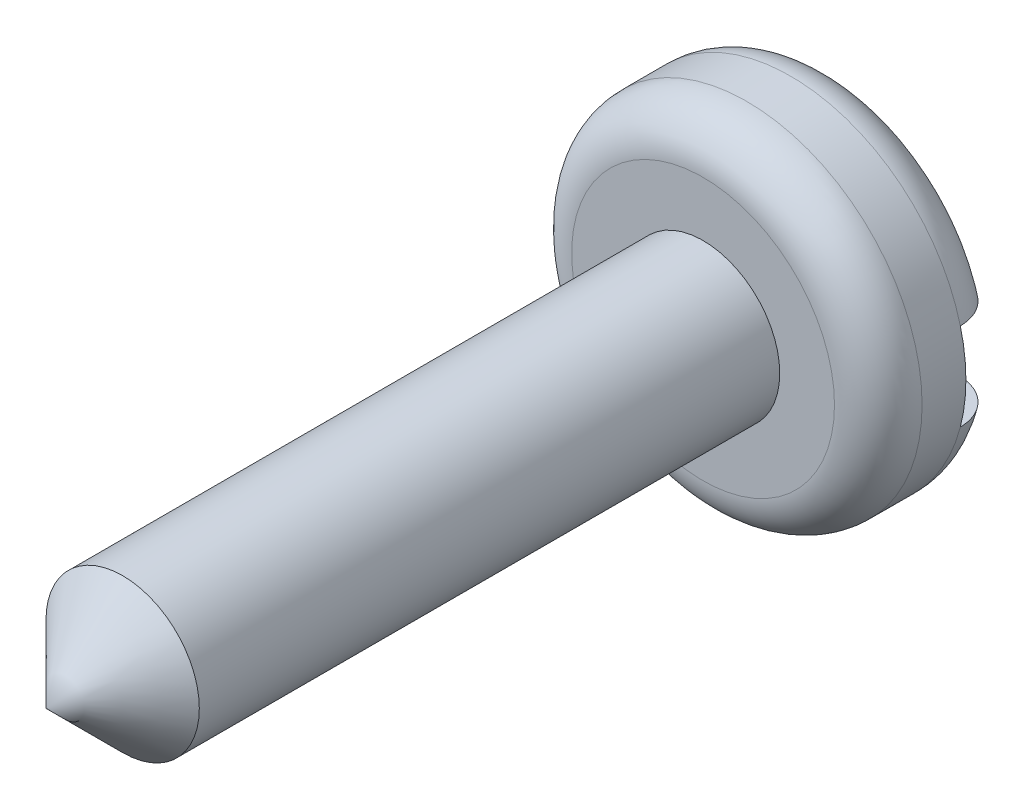
ISO-10303-21;
HEADER;
FILE_DESCRIPTION(('STEP AP214'),'2;1');
FILE_NAME('part.step','',(''),(''),'','','');
FILE_SCHEMA(('AUTOMOTIVE_DESIGN { 1 0 10303 214 1 1 1 1 }'));
ENDSEC;
DATA;
#1=APPLICATION_CONTEXT('core data for automotive mechanical design processes');
#2=APPLICATION_PROTOCOL_DEFINITION('international standard','automotive_design',2000,#1);
#3=PRODUCT_CONTEXT('',#1,'mechanical');
#4=PRODUCT('Part','Part','',(#3));
#5=PRODUCT_RELATED_PRODUCT_CATEGORY('part','',(#4));
#6=PRODUCT_DEFINITION_FORMATION('','',#4);
#7=PRODUCT_DEFINITION_CONTEXT('part definition',#1,'design');
#8=PRODUCT_DEFINITION('design','',#6,#7);
#9=PRODUCT_DEFINITION_SHAPE('','',#8);
#10=(LENGTH_UNIT() NAMED_UNIT(*) SI_UNIT(.MILLI.,.METRE.));
#11=(NAMED_UNIT(*) PLANE_ANGLE_UNIT() SI_UNIT($,.RADIAN.));
#12=(NAMED_UNIT(*) SI_UNIT($,.STERADIAN.) SOLID_ANGLE_UNIT());
#13=UNCERTAINTY_MEASURE_WITH_UNIT(LENGTH_MEASURE(1.E-05),#10,'distance_accuracy_value','');
#14=(GEOMETRIC_REPRESENTATION_CONTEXT(3) GLOBAL_UNCERTAINTY_ASSIGNED_CONTEXT((#13)) GLOBAL_UNIT_ASSIGNED_CONTEXT((#10,
#11,#12)) REPRESENTATION_CONTEXT('',''));
#15=CARTESIAN_POINT('',(0.,0.,0.));
#16=DIRECTION('',(0.,0.,1.));
#17=DIRECTION('',(1.,0.,0.));
#18=AXIS2_PLACEMENT_3D('',#15,#16,#17);
#19=CARTESIAN_POINT('',(0.,0.,0.));
#20=DIRECTION('',(0.,0.,1.));
#21=DIRECTION('',(1.,0.,0.));
#22=AXIS2_PLACEMENT_3D('',#19,#20,#21);
#23=PLANE('',#22);
#24=CARTESIAN_POINT('',(0.,0.,0.));
#25=DIRECTION('',(0.,0.,1.));
#26=DIRECTION('',(1.,0.,0.));
#27=AXIS2_PLACEMENT_3D('',#24,#25,#26);
#28=CIRCLE('',#27,3.);
#29=CARTESIAN_POINT('',(-2.82842712474619,1.,0.));
#30=VERTEX_POINT('',#29);
#31=CARTESIAN_POINT('',(2.82842712474619,1.,0.));
#32=VERTEX_POINT('',#31);
#33=EDGE_CURVE('E126',#30,#32,#28,.F.);
#34=ORIENTED_EDGE('',*,*,#33,.T.);
#35=DIRECTION('',(1.,0.,0.));
#36=VECTOR('',#35,1.);
#37=CARTESIAN_POINT('',(6.17173536215887,1.,0.));
#38=LINE('',#37,#36);
#39=EDGE_CURVE('E173',#30,#32,#38,.T.);
#40=ORIENTED_EDGE('',*,*,#39,.F.);
#41=EDGE_LOOP('',(#34,#40));
#42=FACE_BOUND('',#41,.T.);
#43=ADVANCED_FACE('F39',(#42),#23,.F.);
#44=CARTESIAN_POINT('',(0.,0.,1.));
#45=DIRECTION('',(0.,0.,1.));
#46=DIRECTION('',(1.,0.,0.));
#47=AXIS2_PLACEMENT_3D('',#44,#45,#46);
#48=TOROIDAL_SURFACE('',#47,3.,1.);
#49=CARTESIAN_POINT('',(-3.64919261637876,1.,0.378897333842801));
#50=CARTESIAN_POINT('',(-3.61246829124284,1.,0.334209975057294));
#51=CARTESIAN_POINT('',(-3.57182273981753,1.,0.29267266685047));
#52=CARTESIAN_POINT('',(-3.48403011681508,1.,0.217059540693656));
#53=CARTESIAN_POINT('',(-3.43687198294722,1.,0.182996679297474));
#54=CARTESIAN_POINT('',(-3.33766471841515,1.,0.123259025776858));
#55=CARTESIAN_POINT('',(-3.28562703698927,1.,0.097565201098429));
#56=CARTESIAN_POINT('',(-3.17810296997573,1.,0.0549702755256953));
#57=CARTESIAN_POINT('',(-3.12261754108754,1.,0.0380667475423382));
#58=CARTESIAN_POINT('',(-3.00777317104801,1.,0.0128429918271871));
#59=CARTESIAN_POINT('',(-2.94834671261764,1.,0.00483080172087202));
#60=CARTESIAN_POINT('',(-2.82897631989348,1.,-0.00159564116462503));
#61=CARTESIAN_POINT('',(-2.76903224055403,1.,-7.1103568939486E-06));
#62=CARTESIAN_POINT('',(-2.6472708384319,1.,0.0128422925574044));
#63=CARTESIAN_POINT('',(-2.58550212430651,1.,0.0245647888045193));
#64=CARTESIAN_POINT('',(-2.4646697470406,1.,0.0578517741792593));
#65=CARTESIAN_POINT('',(-2.40560678606223,1.,0.0794188022905919));
#66=CARTESIAN_POINT('',(-2.28977043599634,1.,0.132721610993942));
#67=CARTESIAN_POINT('',(-2.23314594038648,1.,0.164782002317626));
#68=CARTESIAN_POINT('',(-2.12614398768344,1.,0.238084942865307));
#69=CARTESIAN_POINT('',(-2.07576824200821,1.,0.279329998992792));
#70=CARTESIAN_POINT('',(-1.98379387873606,1.,0.369442360556052));
#71=CARTESIAN_POINT('',(-1.94207572966021,1.,0.418187015280968));
#72=CARTESIAN_POINT('',(-1.86845583157665,1.,0.522613781020483));
#73=CARTESIAN_POINT('',(-1.83654566049022,1.,0.578289881968131));
#74=CARTESIAN_POINT('',(-1.78709737368201,1.,0.689264703615614));
#75=CARTESIAN_POINT('',(-1.76846247440006,1.,0.744072419385683));
#76=CARTESIAN_POINT('',(-1.74214733309541,1.,0.856241261169753));
#77=CARTESIAN_POINT('',(-1.73445420066598,1.,0.913599300339002));
#78=CARTESIAN_POINT('',(-1.73084715779128,1.,1.02156224002316));
#79=CARTESIAN_POINT('',(-1.7335962352882,1.,1.07212660231783));
#80=CARTESIAN_POINT('',(-1.74776639815729,1.,1.17201943658103));
#81=CARTESIAN_POINT('',(-1.75918748554878,1.,1.22134790826178));
#82=CARTESIAN_POINT('',(-1.78968272820642,1.,1.31634010173021));
#83=CARTESIAN_POINT('',(-1.8085812374816,1.,1.36206089143509));
#84=CARTESIAN_POINT('',(-1.85313687686153,1.,1.45006787022117));
#85=CARTESIAN_POINT('',(-1.87879592715948,1.,1.49235307902441));
#86=CARTESIAN_POINT('',(-1.93861992774949,1.,1.57655840628574));
#87=CARTESIAN_POINT('',(-1.9733576123982,1.,1.61807079283924));
#88=CARTESIAN_POINT('',(-2.04862460837548,1.,1.69545786058549));
#89=CARTESIAN_POINT('',(-2.08915670758346,1.,1.73132981043539));
#90=CARTESIAN_POINT('',(-2.18006426230812,1.,1.80081027086803));
#91=CARTESIAN_POINT('',(-2.23103714592975,1.,1.83363892322462));
#92=CARTESIAN_POINT('',(-2.33749595959869,1.,1.89091907073592));
#93=CARTESIAN_POINT('',(-2.39298358522971,1.,1.91536740038904));
#94=CARTESIAN_POINT('',(-2.51097262656985,1.,1.9566779062118));
#95=CARTESIAN_POINT('',(-2.57369454510078,1.,1.97291412212961));
#96=CARTESIAN_POINT('',(-2.700983475594,1.,1.99462360905896));
#97=CARTESIAN_POINT('',(-2.76555060284081,1.,2.00009620608553));
#98=CARTESIAN_POINT('',(-2.89460991780328,1.,1.99990136629152));
#99=CARTESIAN_POINT('',(-2.95910210766962,1.,1.99424652406659));
#100=CARTESIAN_POINT('',(-3.08610159103586,1.,1.97170783946254));
#101=CARTESIAN_POINT('',(-3.14860929616319,1.,1.95482634190366));
#102=CARTESIAN_POINT('',(-3.26706008823211,1.,1.91101072015656));
#103=CARTESIAN_POINT('',(-3.32316790541548,1.,1.8845224593714));
#104=CARTESIAN_POINT('',(-3.42981180048591,1.,1.82202844304872));
#105=CARTESIAN_POINT('',(-3.48034948276044,1.,1.78602543828494));
#106=CARTESIAN_POINT('',(-3.5717549595939,1.,1.7074651763323));
#107=CARTESIAN_POINT('',(-3.61297761225985,1.,1.66532063306448));
#108=CARTESIAN_POINT('',(-3.68739921164548,1.,1.57445711562582));
#109=CARTESIAN_POINT('',(-3.72060013192047,1.,1.52573976314336));
#110=CARTESIAN_POINT('',(-3.77666180946586,1.,1.42524395645279));
#111=CARTESIAN_POINT('',(-3.79988449445979,1.,1.37366720330487));
#112=CARTESIAN_POINT('',(-3.8370874932321,1.,1.26728454348738));
#113=CARTESIAN_POINT('',(-3.85106974548789,1.,1.21247931672288));
#114=CARTESIAN_POINT('',(-3.86908893013128,1.,1.10267337847261));
#115=CARTESIAN_POINT('',(-3.8733663936881,1.,1.04771200993106));
#116=CARTESIAN_POINT('',(-3.87254642808437,1.,0.937843717001537));
#117=CARTESIAN_POINT('',(-3.86744696286752,1.,0.882936807028583));
#118=CARTESIAN_POINT('',(-3.84811915821359,1.,0.775214759825382));
#119=CARTESIAN_POINT('',(-3.83396358370818,1.,0.722386480723824));
#120=CARTESIAN_POINT('',(-3.7970545910158,1.,0.619883595919917));
#121=CARTESIAN_POINT('',(-3.77431302491925,1.,0.570204752648263));
#122=CARTESIAN_POINT('',(-3.73340181697249,1.,0.497406676857816));
#123=CARTESIAN_POINT('',(-3.71802299051624,1.,0.472678399414136));
#124=CARTESIAN_POINT('',(-3.6851578718343,1.,0.424666704682951));
#125=CARTESIAN_POINT('',(-3.66767165706015,1.,0.401383234342951));
#126=CARTESIAN_POINT('',(-3.64919261637876,1.,0.378897333842801));
#127=B_SPLINE_CURVE_WITH_KNOTS('',3,(#49,#50,#51,#52,#53,#54,#55,#56,#57,#58,#59,#60,#61,#62,
#63,#64,#65,#66,#67,#68,#69,#70,#71,#72,#73,#74,#75,#76,#77,#78,#79,#80,#81,#82,#83,#84,#85,#86,
#87,#88,#89,#90,#91,#92,#93,#94,#95,#96,#97,#98,#99,#100,#101,#102,#103,#104,#105,#106,#107,
#108,#109,#110,#111,#112,#113,#114,#115,#116,#117,#118,#119,#120,#121,#122,#123,#124,#125,#126),
.UNSPECIFIED.,.T.,.F.,(4,2,2,2,2,2,2,2,2,2,2,2,2,2,2,2,2,2,2,2,2,2,2,2,2,2,2,2,2,2,2,2,2,2,2,2,
2,2,4),(0.,0.17341289048321,0.34712404900796,0.520437356131995,0.69370278427219,
0.872799829737298,1.0519488042302,1.23971596911835,1.42753158804966,1.62181514087839,
1.81615178746787,2.00759452225808,2.19887240354152,2.37152756897142,2.54397916179065,
2.69513969078691,2.8463002549815,2.99410284817722,3.14194746701218,3.30368559089984,
3.46550179575339,3.64661194733467,3.82779043451023,4.02124009008946,4.21470185851019,
4.40794478311448,4.60114735931068,4.78633868776632,4.97147653467569,5.14744892261805,
5.32337797257932,5.49223680329954,5.6610601992052,5.82565137676776,5.99027829700086,
6.15359879124428,6.31669465754746,6.40395620932971,6.49121455501904),.UNSPECIFIED.);
#128=CARTESIAN_POINT('',(-3.87298334620742,1.,1.));
#129=VERTEX_POINT('',#128);
#130=EDGE_CURVE('E48',#129,#30,#127,.T.);
#131=ORIENTED_EDGE('',*,*,#130,.F.);
#132=CARTESIAN_POINT('',(0.,0.,1.));
#133=DIRECTION('',(0.,0.,1.));
#134=DIRECTION('',(1.,0.,0.));
#135=AXIS2_PLACEMENT_3D('',#132,#133,#134);
#136=CIRCLE('',#135,4.);
#137=CARTESIAN_POINT('',(3.87298334620742,1.,1.));
#138=VERTEX_POINT('',#137);
#139=EDGE_CURVE('E133',#138,#129,#136,.T.);
#140=ORIENTED_EDGE('',*,*,#139,.F.);
#141=CARTESIAN_POINT('',(1.80454052912611,1.,0.650412331675416));
#142=CARTESIAN_POINT('',(1.82733564227056,1.,0.596984686528466));
#143=CARTESIAN_POINT('',(1.85512695409011,1.,0.545610280743063));
#144=CARTESIAN_POINT('',(1.91917221491779,1.,0.44834058832476));
#145=CARTESIAN_POINT('',(1.95545034759685,1.,0.402461536743335));
#146=CARTESIAN_POINT('',(2.03472745512996,1.,0.317415138302336));
#147=CARTESIAN_POINT('',(2.07768954567703,1.,0.278213293769102));
#148=CARTESIAN_POINT('',(2.16909853569401,1.,0.206926443062701));
#149=CARTESIAN_POINT('',(2.21754271430982,1.,0.17483792961857));
#150=CARTESIAN_POINT('',(2.32292879249958,1.,0.115948359664502));
#151=CARTESIAN_POINT('',(2.38024241475681,1.,0.0898106906604875));
#152=CARTESIAN_POINT('',(2.49835854595117,1.,0.0471408751783221));
#153=CARTESIAN_POINT('',(2.55916237767374,1.,0.0306123973372757));
#154=CARTESIAN_POINT('',(2.68483407257146,1.,0.00729626138547736));
#155=CARTESIAN_POINT('',(2.74976968404556,1.,0.000870233046596974));
#156=CARTESIAN_POINT('',(2.87978602000167,1.,-0.000704713065899704));
#157=CARTESIAN_POINT('',(2.94486673043529,1.,0.00414532107157648));
#158=CARTESIAN_POINT('',(3.07160057441872,1.,0.0249969888180926));
#159=CARTESIAN_POINT('',(3.13329857714227,1.,0.0407244031872187));
#160=CARTESIAN_POINT('',(3.25294779689383,1.,0.0828418085981355));
#161=CARTESIAN_POINT('',(3.31090002929504,1.,0.109228895921502));
#162=CARTESIAN_POINT('',(3.41840060401574,1.,0.170550133652877));
#163=CARTESIAN_POINT('',(3.46821977750479,1.,0.205009429826692));
#164=CARTESIAN_POINT('',(3.56099783551873,1.,0.28218108711557));
#165=CARTESIAN_POINT('',(3.60395862641663,1.,0.324891147507152));
#166=CARTESIAN_POINT('',(3.67969826358568,1.,0.415185384427619));
#167=CARTESIAN_POINT('',(3.71285769774479,1.,0.462450536940048));
#168=CARTESIAN_POINT('',(3.77044619987703,1.,0.562030626723517));
#169=CARTESIAN_POINT('',(3.79487711958101,1.,0.614344489929528));
#170=CARTESIAN_POINT('',(3.8335016955855,1.,0.720636648548462));
#171=CARTESIAN_POINT('',(3.84801099359635,1.,0.774500409527679));
#172=CARTESIAN_POINT('',(3.86760231954654,1.,0.883914825563264));
#173=CARTESIAN_POINT('',(3.87268548576308,1.,0.939465276115491));
#174=CARTESIAN_POINT('',(3.8732508221602,1.,1.04964495217732));
#175=CARTESIAN_POINT('',(3.86889832192387,1.,1.10427340879512));
#176=CARTESIAN_POINT('',(3.85107174509836,1.,1.21201831105009));
#177=CARTESIAN_POINT('',(3.83759798402113,1.,1.26513480892094));
#178=CARTESIAN_POINT('',(3.80198008919852,1.,1.36831628622124));
#179=CARTESIAN_POINT('',(3.77984406569282,1.,1.41838406955388));
#180=CARTESIAN_POINT('',(3.72759926122775,1.,1.51416605873901));
#181=CARTESIAN_POINT('',(3.69749012843155,1.,1.55988007234758));
#182=CARTESIAN_POINT('',(3.62971259861727,1.,1.64642082838685));
#183=CARTESIAN_POINT('',(3.59193770980213,1.,1.68716409136436));
#184=CARTESIAN_POINT('',(3.51026030542915,1.,1.76195049780548));
#185=CARTESIAN_POINT('',(3.46635709112837,1.,1.79599287617552));
#186=CARTESIAN_POINT('',(3.37229757441458,1.,1.8575273826406));
#187=CARTESIAN_POINT('',(3.3219939157208,1.,1.88479407741084));
#188=CARTESIAN_POINT('',(3.21766120608909,1.,1.93087980880545));
#189=CARTESIAN_POINT('',(3.16363149652713,1.,1.94969734750253));
#190=CARTESIAN_POINT('',(3.05096434144294,1.,1.97921477279298));
#191=CARTESIAN_POINT('',(2.99222867204826,1.,1.98953938747994));
#192=CARTESIAN_POINT('',(2.87386575261448,1.,2.00066868078162));
#193=CARTESIAN_POINT('',(2.81423829904846,1.,2.00147115196093));
#194=CARTESIAN_POINT('',(2.69274321411743,1.,1.99354794260875));
#195=CARTESIAN_POINT('',(2.63090545892967,1.,1.98436299833855));
#196=CARTESIAN_POINT('',(2.50951757591248,1.,1.95613733003393));
#197=CARTESIAN_POINT('',(2.44996803355343,1.,1.93709410142498));
#198=CARTESIAN_POINT('',(2.33251699096482,1.,1.88879805714307));
#199=CARTESIAN_POINT('',(2.27476209452056,1.,1.8591876413013));
#200=CARTESIAN_POINT('',(2.16504100441597,1.,1.79063909658527));
#201=CARTESIAN_POINT('',(2.1130766184798,1.,1.75169806669703));
#202=CARTESIAN_POINT('',(2.01702604048045,1.,1.66559457852408));
#203=CARTESIAN_POINT('',(1.97289236593093,1.,1.61848535508695));
#204=CARTESIAN_POINT('',(1.89405458528472,1.,1.51692534113208));
#205=CARTESIAN_POINT('',(1.8593436749435,1.,1.46247989089578));
#206=CARTESIAN_POINT('',(1.80395346955058,1.,1.3527787762878));
#207=CARTESIAN_POINT('',(1.78231146726499,1.,1.298011759046));
#208=CARTESIAN_POINT('',(1.75007375885358,1.,1.18531186246959));
#209=CARTESIAN_POINT('',(1.73946751412064,1.,1.12738205919617));
#210=CARTESIAN_POINT('',(1.73072871128562,1.,1.01802159475462));
#211=CARTESIAN_POINT('',(1.73118407976635,1.,0.966699039052564));
#212=CARTESIAN_POINT('',(1.74110754539552,1.,0.864988507701978));
#213=CARTESIAN_POINT('',(1.75056109441266,1.,0.81459915730209));
#214=CARTESIAN_POINT('',(1.76962628570817,1.,0.745839139600592));
#215=CARTESIAN_POINT('',(1.775725641812,1.,0.72643247266142));
#216=CARTESIAN_POINT('',(1.78919300721113,1.,0.688070864248412));
#217=CARTESIAN_POINT('',(1.79656062731025,1.,0.669115786219535));
#218=CARTESIAN_POINT('',(1.80454052912611,1.,0.650412331675416));
#219=B_SPLINE_CURVE_WITH_KNOTS('',3,(#141,#142,#143,#144,#145,#146,#147,#148,#149,#150,#151,
#152,#153,#154,#155,#156,#157,#158,#159,#160,#161,#162,#163,#164,#165,#166,#167,#168,#169,#170,
#171,#172,#173,#174,#175,#176,#177,#178,#179,#180,#181,#182,#183,#184,#185,#186,#187,#188,#189,
#190,#191,#192,#193,#194,#195,#196,#197,#198,#199,#200,#201,#202,#203,#204,#205,#206,#207,#208,
#209,#210,#211,#212,#213,#214,#215,#216,#217,#218),.UNSPECIFIED.,.T.,.F.,(4,2,2,2,2,2,2,2,2,2,2,
2,2,2,2,2,2,2,2,2,2,2,2,2,2,2,2,2,2,2,2,2,2,2,2,2,2,2,4),(0.,0.174178142462621,
0.348858794655957,0.522607622456415,0.696270590855761,0.884404317135718,1.07260982280651,
1.26741035602158,1.46219278361548,1.65223564412789,1.84222677141603,2.0230332306349,
2.20378934460626,2.3761397314861,2.54845353295372,2.71499259832305,2.8815115515218,
3.04513641034,3.20875560952792,3.37222198165287,3.53569556841308,3.70161824784469,
3.86755986102035,4.03844662852224,4.20936368011134,4.3874792701433,4.56563615035137,
4.75234573977393,4.93910278752957,5.13289556741605,5.32674867845842,5.51938286742825,
5.71187758161893,5.88751215743834,6.06297885648947,6.21617952361257,6.36913291804395,
6.43012627085521,6.49110093970256),.UNSPECIFIED.);
#220=EDGE_CURVE('E156',#32,#138,#219,.T.);
#221=ORIENTED_EDGE('',*,*,#220,.F.);
#222=ORIENTED_EDGE('',*,*,#33,.F.);
#223=EDGE_LOOP('',(#131,#140,#221,#222));
#224=FACE_BOUND('',#223,.T.);
#225=ADVANCED_FACE('F93',(#224),#48,.T.);
#226=CARTESIAN_POINT('',(0.,0.,3.));
#227=DIRECTION('',(0.,0.,-1.));
#228=DIRECTION('',(-1.,0.,0.));
#229=AXIS2_PLACEMENT_3D('',#226,#227,#228);
#230=CYLINDRICAL_SURFACE('',#229,4.);
#231=ORIENTED_EDGE('',*,*,#139,.T.);
#232=CARTESIAN_POINT('',(-3.87298334620742,-1.,1.));
#233=VERTEX_POINT('',#232);
#234=EDGE_CURVE('E170',#129,#233,#136,.T.);
#235=ORIENTED_EDGE('',*,*,#234,.T.);
#236=CARTESIAN_POINT('',(3.87298334620742,-1.,1.));
#237=VERTEX_POINT('',#236);
#238=EDGE_CURVE('E176',#233,#237,#136,.T.);
#239=ORIENTED_EDGE('',*,*,#238,.T.);
#240=EDGE_CURVE('E171',#237,#138,#136,.T.);
#241=ORIENTED_EDGE('',*,*,#240,.T.);
#242=EDGE_LOOP('',(#231,#235,#239,#241));
#243=FACE_BOUND('',#242,.T.);
#244=CARTESIAN_POINT('',(0.,0.,2.));
#245=DIRECTION('',(0.,0.,1.));
#246=DIRECTION('',(1.,0.,0.));
#247=AXIS2_PLACEMENT_3D('',#244,#245,#246);
#248=CIRCLE('',#247,4.);
#249=CARTESIAN_POINT('',(4.,0.,2.));
#250=VERTEX_POINT('',#249);
#251=EDGE_CURVE('E182',#250,#250,#248,.F.);
#252=ORIENTED_EDGE('',*,*,#251,.T.);
#253=EDGE_LOOP('',(#252));
#254=FACE_BOUND('',#253,.T.);
#255=ADVANCED_FACE('F100',(#243,#254),#230,.T.);
#256=CARTESIAN_POINT('',(0.,0.,3.));
#257=DIRECTION('',(0.,0.,1.));
#258=DIRECTION('',(1.,0.,0.));
#259=AXIS2_PLACEMENT_3D('',#256,#257,#258);
#260=PLANE('',#259);
#261=CARTESIAN_POINT('',(0.,0.,3.));
#262=DIRECTION('',(0.,0.,1.));
#263=DIRECTION('',(1.,0.,0.));
#264=AXIS2_PLACEMENT_3D('',#261,#262,#263);
#265=CIRCLE('',#264,3.);
#266=CARTESIAN_POINT('',(3.,0.,3.));
#267=VERTEX_POINT('',#266);
#268=EDGE_CURVE('E125',#267,#267,#265,.T.);
#269=ORIENTED_EDGE('',*,*,#268,.T.);
#270=EDGE_LOOP('',(#269));
#271=FACE_BOUND('',#270,.T.);
#272=CARTESIAN_POINT('',(0.,0.,3.));
#273=DIRECTION('',(0.,0.,1.));
#274=DIRECTION('',(1.,0.,0.));
#275=AXIS2_PLACEMENT_3D('',#272,#273,#274);
#276=CIRCLE('',#275,1.75);
#277=CARTESIAN_POINT('',(1.75,0.,3.));
#278=VERTEX_POINT('',#277);
#279=EDGE_CURVE('E185',#278,#278,#276,.T.);
#280=ORIENTED_EDGE('',*,*,#279,.F.);
#281=EDGE_LOOP('',(#280));
#282=FACE_BOUND('',#281,.T.);
#283=ADVANCED_FACE('F109',(#271,#282),#260,.T.);
#284=CARTESIAN_POINT('',(2.82842712474619,-1.,0.));
#285=VERTEX_POINT('',#284);
#286=CARTESIAN_POINT('',(-2.82842712474619,-1.,0.));
#287=VERTEX_POINT('',#286);
#288=EDGE_CURVE('E120',#285,#287,#28,.F.);
#289=ORIENTED_EDGE('',*,*,#288,.T.);
#290=DIRECTION('',(-1.,0.,0.));
#291=VECTOR('',#290,1.);
#292=CARTESIAN_POINT('',(6.17173536215887,-1.,0.));
#293=LINE('',#292,#291);
#294=EDGE_CURVE('E121',#285,#287,#293,.T.);
#295=ORIENTED_EDGE('',*,*,#294,.F.);
#296=EDGE_LOOP('',(#289,#295));
#297=FACE_BOUND('',#296,.T.);
#298=ADVANCED_FACE('F96',(#297),#23,.F.);
#299=CARTESIAN_POINT('',(0.,0.,18.));
#300=DIRECTION('',(0.,0.,-1.));
#301=DIRECTION('',(-1.,0.,0.));
#302=AXIS2_PLACEMENT_3D('',#299,#300,#301);
#303=CYLINDRICAL_SURFACE('',#302,1.75);
#304=CARTESIAN_POINT('',(0.,0.,16.25));
#305=DIRECTION('',(0.,0.,1.));
#306=DIRECTION('',(1.,0.,0.));
#307=AXIS2_PLACEMENT_3D('',#304,#305,#306);
#308=CIRCLE('',#307,1.75);
#309=CARTESIAN_POINT('',(1.75,0.,16.25));
#310=VERTEX_POINT('',#309);
#311=EDGE_CURVE('E11',#310,#310,#308,.F.);
#312=ORIENTED_EDGE('',*,*,#311,.T.);
#313=EDGE_LOOP('',(#312));
#314=FACE_BOUND('',#313,.T.);
#315=ORIENTED_EDGE('',*,*,#279,.T.);
#316=EDGE_LOOP('',(#315));
#317=FACE_BOUND('',#316,.T.);
#318=ADVANCED_FACE('F108',(#314,#317),#303,.T.);
#319=CARTESIAN_POINT('',(-3.64919261637876,-1.,0.378897333842801));
#320=CARTESIAN_POINT('',(-3.68421774880566,-1.,0.421525273544426));
#321=CARTESIAN_POINT('',(-3.71573121866812,-1.,0.467084208022854));
#322=CARTESIAN_POINT('',(-3.77072271793606,-1.,0.562863774990084));
#323=CARTESIAN_POINT('',(-3.7941932176755,-1.,0.613088720106644));
#324=CARTESIAN_POINT('',(-3.83232306529217,-1.,0.716807044888567));
#325=CARTESIAN_POINT('',(-3.84697939804536,-1.,0.770301536104798));
#326=CARTESIAN_POINT('',(-3.86697833853991,-1.,0.878993754249563));
#327=CARTESIAN_POINT('',(-3.87232301456639,-1.,0.934191100170905));
#328=CARTESIAN_POINT('',(-3.8735215186672,-1.,1.04404862375726));
#329=CARTESIAN_POINT('',(-3.86948428851038,-1.,1.09870763945698));
#330=CARTESIAN_POINT('',(-3.85227604476183,-1.,1.20656670459816));
#331=CARTESIAN_POINT('',(-3.83910509251853,-1.,1.25976676383649));
#332=CARTESIAN_POINT('',(-3.80407540261861,-1.,1.36315032804431));
#333=CARTESIAN_POINT('',(-3.78222699198927,-1.,1.41333733740324));
#334=CARTESIAN_POINT('',(-3.73053163039543,-1.,1.50940223622213));
#335=CARTESIAN_POINT('',(-3.70068434688085,-1.,1.55527994641752));
#336=CARTESIAN_POINT('',(-3.63341013265124,-1.,1.64217767154251));
#337=CARTESIAN_POINT('',(-3.59587810431412,-1.,1.68311624745889));
#338=CARTESIAN_POINT('',(-3.51465000927728,-1.,1.75832840803727));
#339=CARTESIAN_POINT('',(-3.47095325435915,-1.,1.79260124753158));
#340=CARTESIAN_POINT('',(-3.37728222045449,-1.,1.85462408883627));
#341=CARTESIAN_POINT('',(-3.3271605468789,-1.,1.88215129827028));
#342=CARTESIAN_POINT('',(-3.22314696513099,-1.,1.92878234896095));
#343=CARTESIAN_POINT('',(-3.16925439308441,-1.,1.94788470265974));
#344=CARTESIAN_POINT('',(-3.05682907266059,-1.,1.97799766682329));
#345=CARTESIAN_POINT('',(-2.99819650992226,-1.,1.98863527366622));
#346=CARTESIAN_POINT('',(-2.87998845672231,-1.,2.00040284091296));
#347=CARTESIAN_POINT('',(-2.82041275056072,-1.,2.0015305939671));
#348=CARTESIAN_POINT('',(-2.6989710313189,-1.,1.99427879085429));
#349=CARTESIAN_POINT('',(-2.63713235610346,-1.,1.98544025698446));
#350=CARTESIAN_POINT('',(-2.51568597409779,-1.,1.95790653105362));
#351=CARTESIAN_POINT('',(-2.45607883234357,-1.,1.93920886044527));
#352=CARTESIAN_POINT('',(-2.33842761694778,-1.,1.89160140125571));
#353=CARTESIAN_POINT('',(-2.28052948653965,-1.,1.86232986848529));
#354=CARTESIAN_POINT('',(-2.17045977140093,-1.,1.79444097719273));
#355=CARTESIAN_POINT('',(-2.11828996854253,-1.,1.75582072253099));
#356=CARTESIAN_POINT('',(-2.02170750318936,-1.,1.6702853738109));
#357=CARTESIAN_POINT('',(-1.97725596550883,-1.,1.62341439540988));
#358=CARTESIAN_POINT('',(-1.89772373636244,-1.,1.52227600695239));
#359=CARTESIAN_POINT('',(-1.86263706889656,-1.,1.46801334730142));
#360=CARTESIAN_POINT('',(-1.80643405929272,-1.,1.35850607954028));
#361=CARTESIAN_POINT('',(-1.78437537934672,-1.,1.30374775389467));
#362=CARTESIAN_POINT('',(-1.7513214578145,-1.,1.19100481592052));
#363=CARTESIAN_POINT('',(-1.74031171809329,-1.,1.13302453713014));
#364=CARTESIAN_POINT('',(-1.73085902055685,-1.,1.02353687911254));
#365=CARTESIAN_POINT('',(-1.73099013277704,-1.,0.972149002551751));
#366=CARTESIAN_POINT('',(-1.74029509334647,-1.,0.870204330538246));
#367=CARTESIAN_POINT('',(-1.74946799175208,-1.,0.819647448347301));
#368=CARTESIAN_POINT('',(-1.77571772659471,-1.,0.722908283302294));
#369=CARTESIAN_POINT('',(-1.79245157525915,-1.,0.67663154358046));
#370=CARTESIAN_POINT('',(-1.83286691955322,-1.,0.587231421077743));
#371=CARTESIAN_POINT('',(-1.85655018472788,-1.,0.544108844946483));
#372=CARTESIAN_POINT('',(-1.91213942825224,-1.,0.458398160310175));
#373=CARTESIAN_POINT('',(-1.94456151624895,-1.,0.416145756774348));
#374=CARTESIAN_POINT('',(-2.01532201572512,-1.,0.336932402159019));
#375=CARTESIAN_POINT('',(-2.05366319916079,-1.,0.299973945988354));
#376=CARTESIAN_POINT('',(-2.14017350344001,-1.,0.227756013007773));
#377=CARTESIAN_POINT('',(-2.18897066641048,-1.,0.193247512393862));
#378=CARTESIAN_POINT('',(-2.29132619189354,-1.,0.132206077178104));
#379=CARTESIAN_POINT('',(-2.34488650876452,-1.,0.105676436108591));
#380=CARTESIAN_POINT('',(-2.45975220218697,-1.,0.0594254557303246));
#381=CARTESIAN_POINT('',(-2.52133607697502,-1.,0.0403920226492902));
#382=CARTESIAN_POINT('',(-2.64681911964728,-1.,0.0128387056459453));
#383=CARTESIAN_POINT('',(-2.71071844991052,-1.,0.00431956054764131));
#384=CARTESIAN_POINT('',(-2.83952321891512,-1.,-0.00179756049557264));
#385=CARTESIAN_POINT('',(-2.90443259956797,-1.,0.000685033821560769));
#386=CARTESIAN_POINT('',(-3.03284571779345,-1.,0.0169601469038369));
#387=CARTESIAN_POINT('',(-3.09634932690877,-1.,0.0307536949017249));
#388=CARTESIAN_POINT('',(-3.21753834111487,-1.,0.0687785695905201));
#389=CARTESIAN_POINT('',(-3.27535260668029,-1.,0.0925993019966963));
#390=CARTESIAN_POINT('',(-3.38579347545679,-1.,0.150091956074958));
#391=CARTESIAN_POINT('',(-3.43842837966274,-1.,0.183747759577418));
#392=CARTESIAN_POINT('',(-3.5172967723212,-1.,0.244932928170913));
#393=CARTESIAN_POINT('',(-3.5457566600515,-1.,0.269644856727018));
#394=CARTESIAN_POINT('',(-3.59975362196187,-1.,0.322082057208095));
#395=CARTESIAN_POINT('',(-3.62529080212466,-1.,0.349807219796562));
#396=CARTESIAN_POINT('',(-3.64919261637876,-1.,0.378897333842801));
#397=B_SPLINE_CURVE_WITH_KNOTS('',3,(#319,#320,#321,#322,#323,#324,#325,#326,#327,#328,#329,
#330,#331,#332,#333,#334,#335,#336,#337,#338,#339,#340,#341,#342,#343,#344,#345,#346,#347,#348,
#349,#350,#351,#352,#353,#354,#355,#356,#357,#358,#359,#360,#361,#362,#363,#364,#365,#366,#367,
#368,#369,#370,#371,#372,#373,#374,#375,#376,#377,#378,#379,#380,#381,#382,#383,#384,#385,#386,
#387,#388,#389,#390,#391,#392,#393,#394,#395,#396),.UNSPECIFIED.,.T.,.F.,(4,2,2,2,2,2,2,2,2,2,2,
2,2,2,2,2,2,2,2,2,2,2,2,2,2,2,2,2,2,2,2,2,2,2,2,2,2,2,4),(0.,0.165380840917981,
0.330916087751577,0.496507928228473,0.662062983111424,0.825705250260756,0.989346418285467,
1.15279341803051,1.31624721407641,1.48210686649335,1.64798504984166,1.81876717256352,
1.98957943784094,2.16755619619961,2.34557426393417,2.5321377268739,2.71874811349508,
2.91246419841399,3.1062403715924,3.29901028573085,3.49165689199226,3.66772640012856,
3.84356457111482,3.99693575215231,4.15029082150036,4.29729623412107,4.44433911158016,
4.60347661430523,4.76268886964584,4.9412299082907,5.11984454469074,5.31231684657553,
5.50480267244432,5.69870047136714,5.89261591584997,6.07926324301833,6.2656063831334,
6.37846949761758,6.49132851818112),.UNSPECIFIED.);
#398=EDGE_CURVE('E141',#287,#233,#397,.T.);
#399=ORIENTED_EDGE('',*,*,#398,.F.);
#400=ORIENTED_EDGE('',*,*,#288,.F.);
#401=CARTESIAN_POINT('',(1.80454052912611,-1.,0.650412331675416));
#402=CARTESIAN_POINT('',(1.78501403077482,-1.,0.696188462293334));
#403=CARTESIAN_POINT('',(1.76912481108878,-1.,0.743532357933149));
#404=CARTESIAN_POINT('',(1.74545627326973,-1.,0.840218847889596));
#405=CARTESIAN_POINT('',(1.73767599847123,-1.,0.889561205720812));
#406=CARTESIAN_POINT('',(1.73069098709458,-1.,0.98893034915362));
#407=CARTESIAN_POINT('',(1.73149900893485,-1.,1.03895804273146));
#408=CARTESIAN_POINT('',(1.74167051475476,-1.,1.13813148310028));
#409=CARTESIAN_POINT('',(1.75103489479043,-1.,1.18727713697089));
#410=CARTESIAN_POINT('',(1.77755723399994,-1.,1.28259654690556));
#411=CARTESIAN_POINT('',(1.79459577474986,-1.,1.3288038991579));
#412=CARTESIAN_POINT('',(1.83559644088642,-1.,1.41802494955281));
#413=CARTESIAN_POINT('',(1.85956068083859,-1.,1.46103766725516));
#414=CARTESIAN_POINT('',(1.91574707512422,-1.,1.54654875792902));
#415=CARTESIAN_POINT('',(1.94849285502419,-1.,1.58870215702559));
#416=CARTESIAN_POINT('',(2.01988292900957,-1.,1.66766898849577));
#417=CARTESIAN_POINT('',(2.05852991416201,-1.,1.70447996960674));
#418=CARTESIAN_POINT('',(2.14565957333874,-1.,1.77632950272094));
#419=CARTESIAN_POINT('',(2.1947666390634,-1.,1.8106123025238));
#420=CARTESIAN_POINT('',(2.29770897470277,-1.,1.87114588883134));
#421=CARTESIAN_POINT('',(2.35154617372093,-1.,1.89739337852005));
#422=CARTESIAN_POINT('',(2.46686810930972,-1.,1.94296865639008));
#423=CARTESIAN_POINT('',(2.52862298141813,-1.,1.96161667350933));
#424=CARTESIAN_POINT('',(2.65438564480137,-1.,1.98836271191685));
#425=CARTESIAN_POINT('',(2.71839366607177,-1.,1.99645965295291));
#426=CARTESIAN_POINT('',(2.84727045860239,-1.,2.00169496383021));
#427=CARTESIAN_POINT('',(2.91214210675368,-1.,1.99876496105989));
#428=CARTESIAN_POINT('',(3.04038143311261,-1.,1.98160400020855));
#429=CARTESIAN_POINT('',(3.1037493860516,-1.,1.96737512310821));
#430=CARTESIAN_POINT('',(3.22453607431628,-1.,1.92853719634524));
#431=CARTESIAN_POINT('',(3.28208995374049,-1.,1.90434915733741));
#432=CARTESIAN_POINT('',(3.39200905737906,-1.,1.84616080525272));
#433=CARTESIAN_POINT('',(3.44437578004923,-1.,1.81216333707452));
#434=CARTESIAN_POINT('',(3.53965306827055,-1.,1.73716068328517));
#435=CARTESIAN_POINT('',(3.58290451098822,-1.,1.69658838581379));
#436=CARTESIAN_POINT('',(3.66161338032175,-1.,1.60847843693237));
#437=CARTESIAN_POINT('',(3.69707281002602,-1.,1.56094258088964));
#438=CARTESIAN_POINT('',(3.75765535872457,-1.,1.46241907065484));
#439=CARTESIAN_POINT('',(3.78314865037526,-1.,1.411658829704));
#440=CARTESIAN_POINT('',(3.82498088593506,-1.,1.3064968748371));
#441=CARTESIAN_POINT('',(3.84132142137438,-1.,1.2520957958523));
#442=CARTESIAN_POINT('',(3.86397953776215,-1.,1.14277654991687));
#443=CARTESIAN_POINT('',(3.87055508466128,-1.,1.0879117228444));
#444=CARTESIAN_POINT('',(3.87429421275349,-1.,0.97786412692983));
#445=CARTESIAN_POINT('',(3.87145858580928,-1.,0.922681385227307));
#446=CARTESIAN_POINT('',(3.85654956233586,-1.,0.814172064808558));
#447=CARTESIAN_POINT('',(3.84457328734161,-1.,0.760832094376873));
#448=CARTESIAN_POINT('',(3.81188510349904,-1.,0.656903285597375));
#449=CARTESIAN_POINT('',(3.79117319754571,-1.,0.606314446337843));
#450=CARTESIAN_POINT('',(3.74152269851127,-1.,0.508983084619151));
#451=CARTESIAN_POINT('',(3.7125370484884,-1.,0.462264594203007));
#452=CARTESIAN_POINT('',(3.64728718366139,-1.,0.374228194602638));
#453=CARTESIAN_POINT('',(3.61102243319901,-1.,0.332910683238186));
#454=CARTESIAN_POINT('',(3.53145089102156,-1.,0.255872741074516));
#455=CARTESIAN_POINT('',(3.48801026512743,-1.,0.220290664026862));
#456=CARTESIAN_POINT('',(3.39594466395101,-1.,0.156634325124595));
#457=CARTESIAN_POINT('',(3.34731895276068,-1.,0.128561130978639));
#458=CARTESIAN_POINT('',(3.24444585860384,-1.,0.0796296476512315));
#459=CARTESIAN_POINT('',(3.19006042996428,-1.,0.0590618377537244));
#460=CARTESIAN_POINT('',(3.07870138288986,-1.,0.0269073153310495));
#461=CARTESIAN_POINT('',(3.02172723339545,-1.,0.015322454486726));
#462=CARTESIAN_POINT('',(2.904036237739,-1.,0.000892610032353356));
#463=CARTESIAN_POINT('',(2.84326742888658,-1.,-0.00152817491806245));
#464=CARTESIAN_POINT('',(2.72212957850214,-1.,0.00338441151680097));
#465=CARTESIAN_POINT('',(2.66176061928309,-1.,0.0107197321912066));
#466=CARTESIAN_POINT('',(2.54016743525481,-1.,0.0353585469082781));
#467=CARTESIAN_POINT('',(2.47903356007013,-1.,0.053108892812131));
#468=CARTESIAN_POINT('',(2.36045802696272,-1.,0.098369860177304));
#469=CARTESIAN_POINT('',(2.30301840956722,-1.,0.125885821916339));
#470=CARTESIAN_POINT('',(2.19207907104105,-1.,0.190816000247594));
#471=CARTESIAN_POINT('',(2.13871379054938,-1.,0.228460530118971));
#472=CARTESIAN_POINT('',(2.03938422850455,-1.,0.312466242782807));
#473=CARTESIAN_POINT('',(1.99341141472037,-1.,0.358817240760888));
#474=CARTESIAN_POINT('',(1.92202374047937,-1.,0.445532376303647));
#475=CARTESIAN_POINT('',(1.89441609559324,-1.,0.484105569852356));
#476=CARTESIAN_POINT('',(1.84495839419815,-1.,0.564785392847826));
#477=CARTESIAN_POINT('',(1.82310551704252,-1.,0.606890277874845));
#478=CARTESIAN_POINT('',(1.80454052912611,-1.,0.650412331675416));
#479=B_SPLINE_CURVE_WITH_KNOTS('',3,(#401,#402,#403,#404,#405,#406,#407,#408,#409,#410,#411,
#412,#413,#414,#415,#416,#417,#418,#419,#420,#421,#422,#423,#424,#425,#426,#427,#428,#429,#430,
#431,#432,#433,#434,#435,#436,#437,#438,#439,#440,#441,#442,#443,#444,#445,#446,#447,#448,#449,
#450,#451,#452,#453,#454,#455,#456,#457,#458,#459,#460,#461,#462,#463,#464,#465,#466,#467,#468,
#469,#470,#471,#472,#473,#474,#475,#476,#477,#478),.UNSPECIFIED.,.T.,.F.,(4,2,2,2,2,2,2,2,2,2,2,
2,2,2,2,2,2,2,2,2,2,2,2,2,2,2,2,2,2,2,2,2,2,2,2,2,2,2,4),(0.,0.149148554536908,
0.298279511046727,0.447632041266986,0.597000214073882,0.744120321849422,0.8912853961127,
1.05077942674022,1.21034640823962,1.38925590786663,1.56823871438719,1.76086140940356,
1.95350382418568,2.14734268132878,2.34114584629839,2.52748280590279,2.71376577889491,
2.8907792317187,3.06774712642087,3.23731605857427,3.40685549601413,3.57183112131189,
3.73679286579757,3.90002584186701,4.06325876384109,4.22743923194234,4.3916317862741,
4.55933035639168,4.72705275936769,4.90071055682537,5.07440414134976,5.25604600524081,
5.43772416698673,5.62783456768458,5.81804908988661,6.01302018897483,6.20776461572874,
6.34963856766518,6.4914428514089),.UNSPECIFIED.);
#480=EDGE_CURVE('E79',#237,#285,#479,.T.);
#481=ORIENTED_EDGE('',*,*,#480,.F.);
#482=ORIENTED_EDGE('',*,*,#238,.F.);
#483=EDGE_LOOP('',(#399,#400,#481,#482));
#484=FACE_BOUND('',#483,.T.);
#485=ADVANCED_FACE('F103',(#484),#48,.T.);
#486=CARTESIAN_POINT('',(0.,0.,2.));
#487=DIRECTION('',(0.,0.,1.));
#488=DIRECTION('',(1.,0.,0.));
#489=AXIS2_PLACEMENT_3D('',#486,#487,#488);
#490=TOROIDAL_SURFACE('',#489,3.,1.);
#491=ORIENTED_EDGE('',*,*,#251,.F.);
#492=EDGE_LOOP('',(#491));
#493=FACE_BOUND('',#492,.T.);
#494=ORIENTED_EDGE('',*,*,#268,.F.);
#495=EDGE_LOOP('',(#494));
#496=FACE_BOUND('',#495,.T.);
#497=ADVANCED_FACE('F153',(#493,#496),#490,.T.);
#498=CARTESIAN_POINT('',(6.17173536215887,1.,1.));
#499=DIRECTION('',(0.,1.,0.));
#500=DIRECTION('',(0.,0.,1.));
#501=AXIS2_PLACEMENT_3D('',#498,#499,#500);
#502=PLANE('',#501);
#503=ORIENTED_EDGE('',*,*,#130,.T.);
#504=ORIENTED_EDGE('',*,*,#39,.T.);
#505=ORIENTED_EDGE('',*,*,#220,.T.);
#506=DIRECTION('',(1.,0.,0.));
#507=VECTOR('',#506,1.);
#508=CARTESIAN_POINT('',(6.17173536215887,1.,1.));
#509=LINE('',#508,#507);
#510=EDGE_CURVE('E55',#129,#138,#509,.T.);
#511=ORIENTED_EDGE('',*,*,#510,.F.);
#512=EDGE_LOOP('',(#503,#504,#505,#511));
#513=FACE_BOUND('',#512,.T.);
#514=ADVANCED_FACE('F149',(#513),#502,.F.);
#515=CARTESIAN_POINT('',(6.17173536215887,-1.,1.));
#516=DIRECTION('',(0.,-1.,0.));
#517=DIRECTION('',(0.,0.,-1.));
#518=AXIS2_PLACEMENT_3D('',#515,#516,#517);
#519=PLANE('',#518);
#520=ORIENTED_EDGE('',*,*,#398,.T.);
#521=DIRECTION('',(-1.,0.,0.));
#522=VECTOR('',#521,1.);
#523=CARTESIAN_POINT('',(6.17173536215887,-1.,1.));
#524=LINE('',#523,#522);
#525=EDGE_CURVE('E167',#237,#233,#524,.T.);
#526=ORIENTED_EDGE('',*,*,#525,.F.);
#527=ORIENTED_EDGE('',*,*,#480,.T.);
#528=ORIENTED_EDGE('',*,*,#294,.T.);
#529=EDGE_LOOP('',(#520,#526,#527,#528));
#530=FACE_BOUND('',#529,.T.);
#531=ADVANCED_FACE('F89',(#530),#519,.F.);
#532=CARTESIAN_POINT('',(0.,0.,1.));
#533=DIRECTION('',(0.,0.,1.));
#534=DIRECTION('',(1.,0.,0.));
#535=AXIS2_PLACEMENT_3D('',#532,#533,#534);
#536=PLANE('',#535);
#537=ORIENTED_EDGE('',*,*,#234,.F.);
#538=ORIENTED_EDGE('',*,*,#510,.T.);
#539=ORIENTED_EDGE('',*,*,#240,.F.);
#540=ORIENTED_EDGE('',*,*,#525,.T.);
#541=EDGE_LOOP('',(#537,#538,#539,#540));
#542=FACE_BOUND('',#541,.T.);
#543=ADVANCED_FACE('F84',(#542),#536,.F.);
#544=CARTESIAN_POINT('',(0.,0.,16.25));
#545=DIRECTION('',(0.,0.,-1.));
#546=DIRECTION('',(-1.,0.,0.));
#547=AXIS2_PLACEMENT_3D('',#544,#545,#546);
#548=CONICAL_SURFACE('',#547,1.75,0.785398163397447);
#549=ORIENTED_EDGE('',*,*,#311,.F.);
#550=EDGE_LOOP('',(#549));
#551=FACE_BOUND('',#550,.T.);
#552=CARTESIAN_POINT('',(0.,0.,18.));
#553=VERTEX_POINT('',#552);
#554=VERTEX_LOOP('',#553);
#555=FACE_BOUND('',#554,.T.);
#556=ADVANCED_FACE('F41',(#551,#555),#548,.T.);
#557=CLOSED_SHELL('',(#43,#225,#255,#283,#298,#318,#485,#497,#514,#531,#543,#556));
#558=MANIFOLD_SOLID_BREP('B2',#557);
#559=ADVANCED_BREP_SHAPE_REPRESENTATION('',(#18,#558),#14);
#560=SHAPE_DEFINITION_REPRESENTATION(#9,#559);
ENDSEC;
END-ISO-10303-21;
